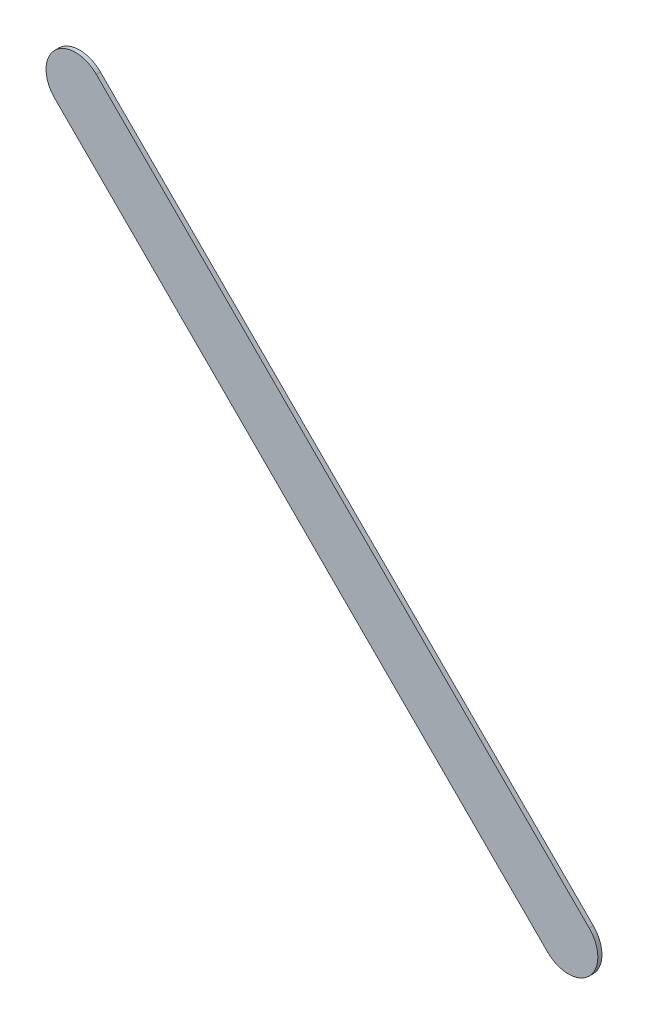
ISO-10303-21;
HEADER;
FILE_DESCRIPTION(('STEP AP214'),'2;1');
FILE_NAME('part.step','',(''),(''),'','','');
FILE_SCHEMA(('AUTOMOTIVE_DESIGN { 1 0 10303 214 1 1 1 1 }'));
ENDSEC;
DATA;
#1=APPLICATION_CONTEXT('core data for automotive mechanical design processes');
#2=APPLICATION_PROTOCOL_DEFINITION('international standard','automotive_design',2000,#1);
#3=PRODUCT_CONTEXT('',#1,'mechanical');
#4=PRODUCT('Part','Part','',(#3));
#5=PRODUCT_RELATED_PRODUCT_CATEGORY('part','',(#4));
#6=PRODUCT_DEFINITION_FORMATION('','',#4);
#7=PRODUCT_DEFINITION_CONTEXT('part definition',#1,'design');
#8=PRODUCT_DEFINITION('design','',#6,#7);
#9=PRODUCT_DEFINITION_SHAPE('','',#8);
#10=(LENGTH_UNIT() NAMED_UNIT(*) SI_UNIT(.MILLI.,.METRE.));
#11=(NAMED_UNIT(*) PLANE_ANGLE_UNIT() SI_UNIT($,.RADIAN.));
#12=(NAMED_UNIT(*) SI_UNIT($,.STERADIAN.) SOLID_ANGLE_UNIT());
#13=UNCERTAINTY_MEASURE_WITH_UNIT(LENGTH_MEASURE(1.E-05),#10,'distance_accuracy_value','');
#14=(GEOMETRIC_REPRESENTATION_CONTEXT(3) GLOBAL_UNCERTAINTY_ASSIGNED_CONTEXT((#13)) GLOBAL_UNIT_ASSIGNED_CONTEXT((#10,
#11,#12)) REPRESENTATION_CONTEXT('',''));
#15=CARTESIAN_POINT('',(0.,0.,0.));
#16=DIRECTION('',(0.,0.,1.));
#17=DIRECTION('',(1.,0.,0.));
#18=AXIS2_PLACEMENT_3D('',#15,#16,#17);
#19=CARTESIAN_POINT('',(178.611776,-90.882223,0.));
#20=DIRECTION('',(0.,0.,1.));
#21=DIRECTION('',(1.,0.,0.));
#22=AXIS2_PLACEMENT_3D('',#19,#20,#21);
#23=PLANE('',#22);
#24=DIRECTION('',(-0.707106781186548,0.707106781186548,0.));
#25=VECTOR('',#24,1.);
#26=CARTESIAN_POINT('',(178.611776,-90.882223,0.));
#27=LINE('',#26,#25);
#28=CARTESIAN_POINT('',(178.611776,-90.882223,0.));
#29=VERTEX_POINT('',#28);
#30=CARTESIAN_POINT('',(174.420776,-86.691223,0.));
#31=VERTEX_POINT('',#30);
#32=EDGE_CURVE('E99',#29,#31,#27,.T.);
#33=ORIENTED_EDGE('',*,*,#32,.T.);
#34=CARTESIAN_POINT('',(174.2439995,-86.8679995,0.));
#35=DIRECTION('',(0.,0.,1.));
#36=DIRECTION('',(0.707106781186548,0.707106781186548,0.));
#37=AXIS2_PLACEMENT_3D('',#34,#35,#36);
#38=CIRCLE('',#37,0.249999723809);
#39=CARTESIAN_POINT('',(174.067223,-87.044776,0.));
#40=VERTEX_POINT('',#39);
#41=EDGE_CURVE('E79',#31,#40,#38,.T.);
#42=ORIENTED_EDGE('',*,*,#41,.T.);
#43=DIRECTION('',(0.707106781186548,-0.707106781186548,0.));
#44=VECTOR('',#43,1.);
#45=CARTESIAN_POINT('',(174.067223,-87.044776,0.));
#46=LINE('',#45,#44);
#47=CARTESIAN_POINT('',(178.258223,-91.235776,0.));
#48=VERTEX_POINT('',#47);
#49=EDGE_CURVE('E20',#40,#48,#46,.T.);
#50=ORIENTED_EDGE('',*,*,#49,.T.);
#51=CARTESIAN_POINT('',(178.4349995,-91.0589995,0.));
#52=DIRECTION('',(0.,0.,1.));
#53=DIRECTION('',(-0.707106781186548,-0.707106781186548,0.));
#54=AXIS2_PLACEMENT_3D('',#51,#52,#53);
#55=CIRCLE('',#54,0.249999723809);
#56=EDGE_CURVE('E11',#48,#29,#55,.T.);
#57=ORIENTED_EDGE('',*,*,#56,.T.);
#58=EDGE_LOOP('',(#33,#42,#50,#57));
#59=FACE_BOUND('',#58,.T.);
#60=ADVANCED_FACE('F17',(#59),#23,.T.);
#61=CARTESIAN_POINT('',(178.611776,-90.882223,-0.035));
#62=DIRECTION('',(0.,0.,1.));
#63=DIRECTION('',(1.,0.,0.));
#64=AXIS2_PLACEMENT_3D('',#61,#62,#63);
#65=PLANE('',#64);
#66=CARTESIAN_POINT('',(178.4349995,-91.0589995,-0.035));
#67=DIRECTION('',(0.,0.,1.));
#68=DIRECTION('',(-0.707106781186548,-0.707106781186548,0.));
#69=AXIS2_PLACEMENT_3D('',#66,#67,#68);
#70=CIRCLE('',#69,0.249999723809);
#71=CARTESIAN_POINT('',(178.258223,-91.235776,-0.035));
#72=VERTEX_POINT('',#71);
#73=CARTESIAN_POINT('',(178.611776,-90.882223,-0.035));
#74=VERTEX_POINT('',#73);
#75=EDGE_CURVE('E26',#72,#74,#70,.T.);
#76=ORIENTED_EDGE('',*,*,#75,.F.);
#77=DIRECTION('',(0.707106781186548,-0.707106781186548,0.));
#78=VECTOR('',#77,1.);
#79=CARTESIAN_POINT('',(174.067223,-87.044776,-0.035));
#80=LINE('',#79,#78);
#81=CARTESIAN_POINT('',(174.067223,-87.044776,-0.035));
#82=VERTEX_POINT('',#81);
#83=EDGE_CURVE('E69',#82,#72,#80,.T.);
#84=ORIENTED_EDGE('',*,*,#83,.F.);
#85=CARTESIAN_POINT('',(174.2439995,-86.8679995,-0.035));
#86=DIRECTION('',(0.,0.,1.));
#87=DIRECTION('',(0.707106781186548,0.707106781186548,0.));
#88=AXIS2_PLACEMENT_3D('',#85,#86,#87);
#89=CIRCLE('',#88,0.249999723809);
#90=CARTESIAN_POINT('',(174.420776,-86.691223,-0.035));
#91=VERTEX_POINT('',#90);
#92=EDGE_CURVE('E73',#91,#82,#89,.T.);
#93=ORIENTED_EDGE('',*,*,#92,.F.);
#94=DIRECTION('',(-0.707106781186548,0.707106781186548,0.));
#95=VECTOR('',#94,1.);
#96=CARTESIAN_POINT('',(178.611776,-90.882223,-0.035));
#97=LINE('',#96,#95);
#98=EDGE_CURVE('E119',#74,#91,#97,.T.);
#99=ORIENTED_EDGE('',*,*,#98,.F.);
#100=EDGE_LOOP('',(#76,#84,#93,#99));
#101=FACE_BOUND('',#100,.T.);
#102=ADVANCED_FACE('F71',(#101),#65,.F.);
#103=CARTESIAN_POINT('',(178.4349995,-91.0589995,-0.035));
#104=DIRECTION('',(0.,0.,-1.));
#105=DIRECTION('',(-0.707106781186548,-0.707106781186548,0.));
#106=AXIS2_PLACEMENT_3D('',#103,#104,#105);
#107=CYLINDRICAL_SURFACE('',#106,0.249999723809);
#108=ORIENTED_EDGE('',*,*,#75,.T.);
#109=DIRECTION('',(0.,0.,1.));
#110=VECTOR('',#109,1.);
#111=CARTESIAN_POINT('',(178.611776,-90.882223,-0.035));
#112=LINE('',#111,#110);
#113=EDGE_CURVE('E93',#74,#29,#112,.T.);
#114=ORIENTED_EDGE('',*,*,#113,.T.);
#115=ORIENTED_EDGE('',*,*,#56,.F.);
#116=DIRECTION('',(0.,0.,1.));
#117=VECTOR('',#116,1.);
#118=CARTESIAN_POINT('',(178.258223,-91.235776,-0.035));
#119=LINE('',#118,#117);
#120=EDGE_CURVE('E78',#72,#48,#119,.T.);
#121=ORIENTED_EDGE('',*,*,#120,.F.);
#122=EDGE_LOOP('',(#108,#114,#115,#121));
#123=FACE_BOUND('',#122,.T.);
#124=ADVANCED_FACE('F174',(#123),#107,.T.);
#125=CARTESIAN_POINT('',(174.067223,-87.044776,-0.035));
#126=DIRECTION('',(0.707106781186548,0.707106781186548,0.));
#127=DIRECTION('',(0.,0.,-1.));
#128=AXIS2_PLACEMENT_3D('',#125,#126,#127);
#129=PLANE('',#128);
#130=ORIENTED_EDGE('',*,*,#83,.T.);
#131=ORIENTED_EDGE('',*,*,#120,.T.);
#132=ORIENTED_EDGE('',*,*,#49,.F.);
#133=DIRECTION('',(0.,0.,1.));
#134=VECTOR('',#133,1.);
#135=CARTESIAN_POINT('',(174.067223,-87.044776,-0.035));
#136=LINE('',#135,#134);
#137=EDGE_CURVE('E82',#82,#40,#136,.T.);
#138=ORIENTED_EDGE('',*,*,#137,.F.);
#139=EDGE_LOOP('',(#130,#131,#132,#138));
#140=FACE_BOUND('',#139,.T.);
#141=ADVANCED_FACE('F83',(#140),#129,.F.);
#142=CARTESIAN_POINT('',(174.2439995,-86.8679995,-0.035));
#143=DIRECTION('',(0.,0.,-1.));
#144=DIRECTION('',(0.707106781186548,0.707106781186548,0.));
#145=AXIS2_PLACEMENT_3D('',#142,#143,#144);
#146=CYLINDRICAL_SURFACE('',#145,0.249999723809);
#147=ORIENTED_EDGE('',*,*,#92,.T.);
#148=ORIENTED_EDGE('',*,*,#137,.T.);
#149=ORIENTED_EDGE('',*,*,#41,.F.);
#150=DIRECTION('',(0.,0.,1.));
#151=VECTOR('',#150,1.);
#152=CARTESIAN_POINT('',(174.420776,-86.691223,-0.035));
#153=LINE('',#152,#151);
#154=EDGE_CURVE('E90',#91,#31,#153,.T.);
#155=ORIENTED_EDGE('',*,*,#154,.F.);
#156=EDGE_LOOP('',(#147,#148,#149,#155));
#157=FACE_BOUND('',#156,.T.);
#158=ADVANCED_FACE('F88',(#157),#146,.T.);
#159=CARTESIAN_POINT('',(178.611776,-90.882223,-0.035));
#160=DIRECTION('',(-0.707106781186548,-0.707106781186548,0.));
#161=DIRECTION('',(-0.707106781186548,0.707106781186548,0.));
#162=AXIS2_PLACEMENT_3D('',#159,#160,#161);
#163=PLANE('',#162);
#164=ORIENTED_EDGE('',*,*,#98,.T.);
#165=ORIENTED_EDGE('',*,*,#154,.T.);
#166=ORIENTED_EDGE('',*,*,#32,.F.);
#167=ORIENTED_EDGE('',*,*,#113,.F.);
#168=EDGE_LOOP('',(#164,#165,#166,#167));
#169=FACE_BOUND('',#168,.T.);
#170=ADVANCED_FACE('F142',(#169),#163,.F.);
#171=CLOSED_SHELL('',(#60,#102,#124,#141,#158,#170));
#172=MANIFOLD_SOLID_BREP('B1',#171);
#173=ADVANCED_BREP_SHAPE_REPRESENTATION('',(#18,#172),#14);
#174=SHAPE_DEFINITION_REPRESENTATION(#9,#173);
ENDSEC;
END-ISO-10303-21;
